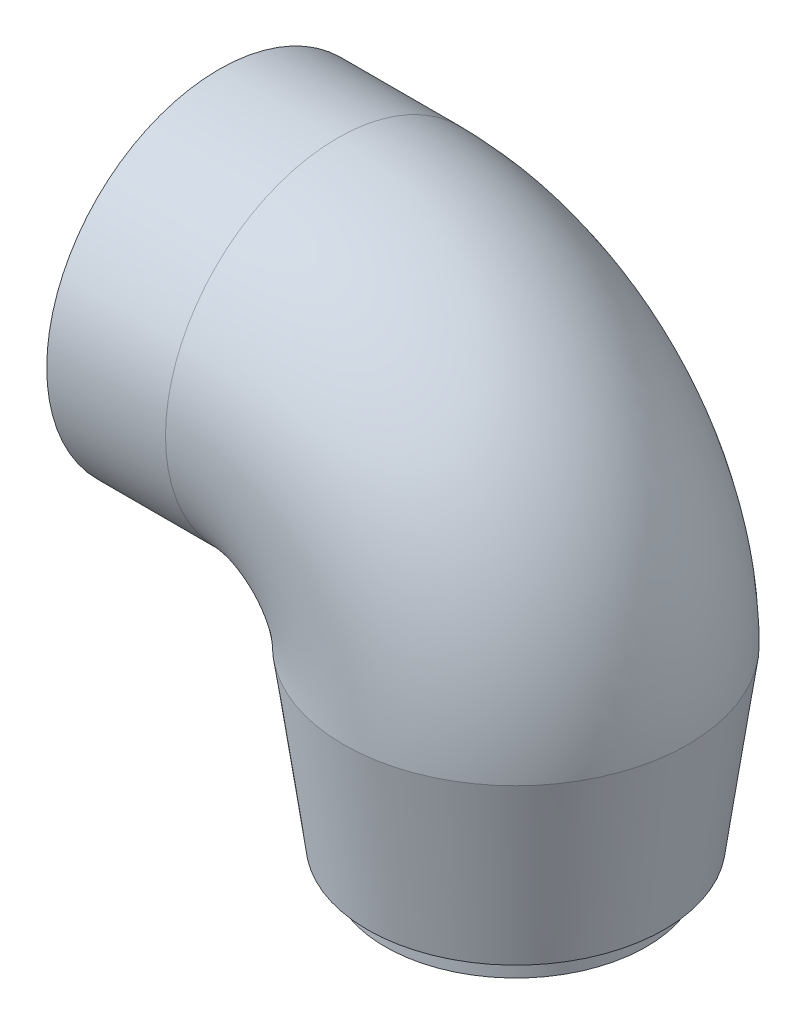
ISO-10303-21;
HEADER;
FILE_DESCRIPTION(('STEP AP214'),'2;1');
FILE_NAME('part.step','',(''),(''),'','','');
FILE_SCHEMA(('AUTOMOTIVE_DESIGN { 1 0 10303 214 1 1 1 1 }'));
ENDSEC;
DATA;
#1=APPLICATION_CONTEXT('core data for automotive mechanical design processes');
#2=APPLICATION_PROTOCOL_DEFINITION('international standard','automotive_design',2000,#1);
#3=PRODUCT_CONTEXT('',#1,'mechanical');
#4=PRODUCT('Part','Part','',(#3));
#5=PRODUCT_RELATED_PRODUCT_CATEGORY('part','',(#4));
#6=PRODUCT_DEFINITION_FORMATION('','',#4);
#7=PRODUCT_DEFINITION_CONTEXT('part definition',#1,'design');
#8=PRODUCT_DEFINITION('design','',#6,#7);
#9=PRODUCT_DEFINITION_SHAPE('','',#8);
#10=(LENGTH_UNIT() NAMED_UNIT(*) SI_UNIT(.MILLI.,.METRE.));
#11=(NAMED_UNIT(*) PLANE_ANGLE_UNIT() SI_UNIT($,.RADIAN.));
#12=(NAMED_UNIT(*) SI_UNIT($,.STERADIAN.) SOLID_ANGLE_UNIT());
#13=UNCERTAINTY_MEASURE_WITH_UNIT(LENGTH_MEASURE(1.E-05),#10,'distance_accuracy_value','');
#14=(GEOMETRIC_REPRESENTATION_CONTEXT(3) GLOBAL_UNCERTAINTY_ASSIGNED_CONTEXT((#13)) GLOBAL_UNIT_ASSIGNED_CONTEXT((#10,
#11,#12)) REPRESENTATION_CONTEXT('',''));
#15=CARTESIAN_POINT('',(0.,0.,0.));
#16=DIRECTION('',(0.,0.,1.));
#17=DIRECTION('',(1.,0.,0.));
#18=AXIS2_PLACEMENT_3D('',#15,#16,#17);
#19=CARTESIAN_POINT('',(30.,-29.,0.));
#20=DIRECTION('',(0.,-1.,0.));
#21=DIRECTION('',(0.,0.,-1.));
#22=AXIS2_PLACEMENT_3D('',#19,#20,#21);
#23=PLANE('',#22);
#24=CARTESIAN_POINT('',(30.,-29.,0.));
#25=DIRECTION('',(0.,-1.,0.));
#26=DIRECTION('',(0.,0.,-1.));
#27=AXIS2_PLACEMENT_3D('',#24,#25,#26);
#28=CIRCLE('',#27,22.);
#29=CARTESIAN_POINT('',(30.,-29.,-22.));
#30=VERTEX_POINT('',#29);
#31=EDGE_CURVE('E72',#30,#30,#28,.T.);
#32=ORIENTED_EDGE('',*,*,#31,.F.);
#33=EDGE_LOOP('',(#32));
#34=FACE_BOUND('',#33,.T.);
#35=CARTESIAN_POINT('',(30.,-29.,0.));
#36=DIRECTION('',(0.,1.,0.));
#37=DIRECTION('',(0.,0.,1.));
#38=AXIS2_PLACEMENT_3D('',#35,#36,#37);
#39=CIRCLE('',#38,25.);
#40=CARTESIAN_POINT('',(30.,-29.,25.));
#41=VERTEX_POINT('',#40);
#42=EDGE_CURVE('E76',#41,#41,#39,.T.);
#43=ORIENTED_EDGE('',*,*,#42,.F.);
#44=EDGE_LOOP('',(#43));
#45=FACE_BOUND('',#44,.T.);
#46=ADVANCED_FACE('F35',(#34,#45),#23,.T.);
#47=CARTESIAN_POINT('',(30.,-33.,0.));
#48=DIRECTION('',(0.,1.,0.));
#49=DIRECTION('',(0.,0.,1.));
#50=AXIS2_PLACEMENT_3D('',#47,#48,#49);
#51=PLANE('',#50);
#52=CARTESIAN_POINT('',(30.,-33.,0.));
#53=DIRECTION('',(0.,1.,0.));
#54=DIRECTION('',(0.,0.,1.));
#55=AXIS2_PLACEMENT_3D('',#52,#53,#54);
#56=CIRCLE('',#55,20.);
#57=CARTESIAN_POINT('',(30.,-33.,20.));
#58=VERTEX_POINT('',#57);
#59=EDGE_CURVE('E69',#58,#58,#56,.T.);
#60=ORIENTED_EDGE('',*,*,#59,.T.);
#61=EDGE_LOOP('',(#60));
#62=FACE_BOUND('',#61,.T.);
#63=CARTESIAN_POINT('',(30.,-33.,0.));
#64=DIRECTION('',(0.,-1.,0.));
#65=DIRECTION('',(0.,0.,-1.));
#66=AXIS2_PLACEMENT_3D('',#63,#64,#65);
#67=CIRCLE('',#66,22.);
#68=CARTESIAN_POINT('',(30.,-33.,-22.));
#69=VERTEX_POINT('',#68);
#70=EDGE_CURVE('E73',#69,#69,#67,.T.);
#71=ORIENTED_EDGE('',*,*,#70,.T.);
#72=EDGE_LOOP('',(#71));
#73=FACE_BOUND('',#72,.T.);
#74=ADVANCED_FACE('F86',(#62,#73),#51,.F.);
#75=CARTESIAN_POINT('',(-20.,30.,0.));
#76=DIRECTION('',(1.,0.,0.));
#77=DIRECTION('',(0.,1.,0.));
#78=AXIS2_PLACEMENT_3D('',#75,#76,#77);
#79=CYLINDRICAL_SURFACE('',#78,25.);
#80=CARTESIAN_POINT('',(0.,30.,0.));
#81=DIRECTION('',(-1.,0.,0.));
#82=DIRECTION('',(0.,0.,1.));
#83=AXIS2_PLACEMENT_3D('',#80,#81,#82);
#84=CIRCLE('',#83,25.);
#85=CARTESIAN_POINT('',(0.,55.,0.));
#86=VERTEX_POINT('',#85);
#87=EDGE_CURVE('E43',#86,#86,#84,.F.);
#88=ORIENTED_EDGE('',*,*,#87,.T.);
#89=EDGE_LOOP('',(#88));
#90=FACE_BOUND('',#89,.T.);
#91=CARTESIAN_POINT('',(-13.,30.,0.));
#92=DIRECTION('',(-1.,0.,0.));
#93=DIRECTION('',(0.,0.,1.));
#94=AXIS2_PLACEMENT_3D('',#91,#92,#93);
#95=CIRCLE('',#94,25.);
#96=CARTESIAN_POINT('',(-13.,30.,25.));
#97=VERTEX_POINT('',#96);
#98=EDGE_CURVE('E65',#97,#97,#95,.T.);
#99=ORIENTED_EDGE('',*,*,#98,.T.);
#100=EDGE_LOOP('',(#99));
#101=FACE_BOUND('',#100,.T.);
#102=ADVANCED_FACE('F92',(#90,#101),#79,.F.);
#103=CARTESIAN_POINT('',(-20.,30.,0.));
#104=DIRECTION('',(1.,0.,0.));
#105=DIRECTION('',(0.,1.,0.));
#106=AXIS2_PLACEMENT_3D('',#103,#104,#105);
#107=CYLINDRICAL_SURFACE('',#106,29.);
#108=CARTESIAN_POINT('',(0.,30.,0.));
#109=DIRECTION('',(-1.,0.,0.));
#110=DIRECTION('',(0.,0.,1.));
#111=AXIS2_PLACEMENT_3D('',#108,#109,#110);
#112=CIRCLE('',#111,29.);
#113=CARTESIAN_POINT('',(0.,59.,0.));
#114=VERTEX_POINT('',#113);
#115=EDGE_CURVE('E53',#114,#114,#112,.T.);
#116=ORIENTED_EDGE('',*,*,#115,.T.);
#117=EDGE_LOOP('',(#116));
#118=FACE_BOUND('',#117,.T.);
#119=CARTESIAN_POINT('',(-20.,30.,0.));
#120=DIRECTION('',(-1.,0.,0.));
#121=DIRECTION('',(0.,0.,1.));
#122=AXIS2_PLACEMENT_3D('',#119,#120,#121);
#123=CIRCLE('',#122,29.);
#124=CARTESIAN_POINT('',(-20.,30.,29.));
#125=VERTEX_POINT('',#124);
#126=EDGE_CURVE('E48',#125,#125,#123,.T.);
#127=ORIENTED_EDGE('',*,*,#126,.F.);
#128=EDGE_LOOP('',(#127));
#129=FACE_BOUND('',#128,.T.);
#130=ADVANCED_FACE('F113',(#118,#129),#107,.T.);
#131=CARTESIAN_POINT('',(0.,0.,0.));
#132=DIRECTION('',(0.,0.,-1.));
#133=DIRECTION('',(-1.,0.,0.));
#134=AXIS2_PLACEMENT_3D('',#131,#132,#133);
#135=TOROIDAL_SURFACE('',#134,30.,29.);
#136=CARTESIAN_POINT('',(30.,0.,0.));
#137=DIRECTION('',(0.,1.,0.));
#138=DIRECTION('',(0.,0.,1.));
#139=AXIS2_PLACEMENT_3D('',#136,#137,#138);
#140=CIRCLE('',#139,29.);
#141=CARTESIAN_POINT('',(59.,0.,0.));
#142=VERTEX_POINT('',#141);
#143=EDGE_CURVE('E39',#142,#142,#140,.T.);
#144=CARTESIAN_POINT('',(0.,0.,0.));
#145=DIRECTION('',(0.,0.,-1.));
#146=DIRECTION('',(-1.,0.,0.));
#147=AXIS2_PLACEMENT_3D('',#144,#145,#146);
#148=CIRCLE('',#147,59.);
#149=EDGE_CURVE('',#114,#142,#148,.T.);
#150=ORIENTED_EDGE('',*,*,#115,.F.);
#151=ORIENTED_EDGE('',*,*,#143,.T.);
#152=ORIENTED_EDGE('',*,*,#149,.T.);
#153=ORIENTED_EDGE('',*,*,#149,.F.);
#154=EDGE_LOOP('',(#150,#152,#151,#153));
#155=FACE_BOUND('',#154,.T.);
#156=ADVANCED_FACE('F37',(#155),#135,.T.);
#157=CARTESIAN_POINT('',(-20.,30.,0.));
#158=DIRECTION('',(-1.,0.,0.));
#159=DIRECTION('',(0.,0.,1.));
#160=AXIS2_PLACEMENT_3D('',#157,#158,#159);
#161=PLANE('',#160);
#162=CARTESIAN_POINT('',(-20.,30.,0.));
#163=DIRECTION('',(-1.,0.,0.));
#164=DIRECTION('',(0.,0.,1.));
#165=AXIS2_PLACEMENT_3D('',#162,#163,#164);
#166=CIRCLE('',#165,27.);
#167=CARTESIAN_POINT('',(-20.,30.,27.));
#168=VERTEX_POINT('',#167);
#169=EDGE_CURVE('E60',#168,#168,#166,.T.);
#170=ORIENTED_EDGE('',*,*,#169,.F.);
#171=EDGE_LOOP('',(#170));
#172=FACE_BOUND('',#171,.T.);
#173=ORIENTED_EDGE('',*,*,#126,.T.);
#174=EDGE_LOOP('',(#173));
#175=FACE_BOUND('',#174,.T.);
#176=ADVANCED_FACE('F118',(#172,#175),#161,.T.);
#177=CARTESIAN_POINT('',(0.,0.,0.));
#178=DIRECTION('',(0.,0.,-1.));
#179=DIRECTION('',(-1.,0.,0.));
#180=AXIS2_PLACEMENT_3D('',#177,#178,#179);
#181=TOROIDAL_SURFACE('',#180,30.,25.);
#182=CARTESIAN_POINT('',(30.,0.,0.));
#183=DIRECTION('',(0.,1.,0.));
#184=DIRECTION('',(0.,0.,1.));
#185=AXIS2_PLACEMENT_3D('',#182,#183,#184);
#186=CIRCLE('',#185,25.);
#187=CARTESIAN_POINT('',(55.,0.,0.));
#188=VERTEX_POINT('',#187);
#189=EDGE_CURVE('E10',#188,#188,#186,.F.);
#190=CARTESIAN_POINT('',(0.,0.,0.));
#191=DIRECTION('',(0.,0.,-1.));
#192=DIRECTION('',(-1.,0.,0.));
#193=AXIS2_PLACEMENT_3D('',#190,#191,#192);
#194=CIRCLE('',#193,55.);
#195=EDGE_CURVE('',#86,#188,#194,.T.);
#196=ORIENTED_EDGE('',*,*,#87,.F.);
#197=ORIENTED_EDGE('',*,*,#189,.T.);
#198=ORIENTED_EDGE('',*,*,#195,.T.);
#199=ORIENTED_EDGE('',*,*,#195,.F.);
#200=EDGE_LOOP('',(#196,#198,#197,#199));
#201=FACE_BOUND('',#200,.T.);
#202=ADVANCED_FACE('F111',(#201),#181,.F.);
#203=CARTESIAN_POINT('',(-13.,30.,0.));
#204=DIRECTION('',(-1.,0.,0.));
#205=DIRECTION('',(0.,0.,1.));
#206=AXIS2_PLACEMENT_3D('',#203,#204,#205);
#207=CYLINDRICAL_SURFACE('',#206,27.);
#208=CARTESIAN_POINT('',(-13.,30.,0.));
#209=DIRECTION('',(-1.,0.,0.));
#210=DIRECTION('',(0.,0.,1.));
#211=AXIS2_PLACEMENT_3D('',#208,#209,#210);
#212=CIRCLE('',#211,27.);
#213=CARTESIAN_POINT('',(-13.,30.,27.));
#214=VERTEX_POINT('',#213);
#215=EDGE_CURVE('E55',#214,#214,#212,.T.);
#216=ORIENTED_EDGE('',*,*,#215,.F.);
#217=EDGE_LOOP('',(#216));
#218=FACE_BOUND('',#217,.T.);
#219=ORIENTED_EDGE('',*,*,#169,.T.);
#220=EDGE_LOOP('',(#219));
#221=FACE_BOUND('',#220,.T.);
#222=ADVANCED_FACE('F107',(#218,#221),#207,.F.);
#223=CARTESIAN_POINT('',(-13.,30.,0.));
#224=DIRECTION('',(-1.,0.,0.));
#225=DIRECTION('',(0.,0.,1.));
#226=AXIS2_PLACEMENT_3D('',#223,#224,#225);
#227=PLANE('',#226);
#228=ORIENTED_EDGE('',*,*,#98,.F.);
#229=EDGE_LOOP('',(#228));
#230=FACE_BOUND('',#229,.T.);
#231=ORIENTED_EDGE('',*,*,#215,.T.);
#232=EDGE_LOOP('',(#231));
#233=FACE_BOUND('',#232,.T.);
#234=ADVANCED_FACE('F103',(#230,#233),#227,.T.);
#235=CARTESIAN_POINT('',(30.,0.,0.));
#236=DIRECTION('',(0.,1.,0.));
#237=DIRECTION('',(0.,0.,1.));
#238=AXIS2_PLACEMENT_3D('',#235,#236,#237);
#239=CONICAL_SURFACE('',#238,25.,0.150371428007135);
#240=ORIENTED_EDGE('',*,*,#59,.F.);
#241=EDGE_LOOP('',(#240));
#242=FACE_BOUND('',#241,.T.);
#243=ORIENTED_EDGE('',*,*,#189,.F.);
#244=EDGE_LOOP('',(#243));
#245=FACE_BOUND('',#244,.T.);
#246=ADVANCED_FACE('F100',(#242,#245),#239,.F.);
#247=CARTESIAN_POINT('',(30.,-29.,0.));
#248=DIRECTION('',(0.,-1.,0.));
#249=DIRECTION('',(0.,0.,-1.));
#250=AXIS2_PLACEMENT_3D('',#247,#248,#249);
#251=CYLINDRICAL_SURFACE('',#250,22.);
#252=ORIENTED_EDGE('',*,*,#31,.T.);
#253=EDGE_LOOP('',(#252));
#254=FACE_BOUND('',#253,.T.);
#255=ORIENTED_EDGE('',*,*,#70,.F.);
#256=EDGE_LOOP('',(#255));
#257=FACE_BOUND('',#256,.T.);
#258=ADVANCED_FACE('F98',(#254,#257),#251,.T.);
#259=CARTESIAN_POINT('',(30.,0.,0.));
#260=DIRECTION('',(0.,1.,0.));
#261=DIRECTION('',(0.,0.,1.));
#262=AXIS2_PLACEMENT_3D('',#259,#260,#261);
#263=CONICAL_SURFACE('',#262,29.,0.137066174310187);
#264=ORIENTED_EDGE('',*,*,#42,.T.);
#265=EDGE_LOOP('',(#264));
#266=FACE_BOUND('',#265,.T.);
#267=ORIENTED_EDGE('',*,*,#143,.F.);
#268=EDGE_LOOP('',(#267));
#269=FACE_BOUND('',#268,.T.);
#270=ADVANCED_FACE('F82',(#266,#269),#263,.T.);
#271=CLOSED_SHELL('',(#46,#74,#102,#130,#156,#176,#202,#222,#234,#246,#258,#270));
#272=MANIFOLD_SOLID_BREP('B2',#271);
#273=ADVANCED_BREP_SHAPE_REPRESENTATION('',(#18,#272),#14);
#274=SHAPE_DEFINITION_REPRESENTATION(#9,#273);
ENDSEC;
END-ISO-10303-21;
